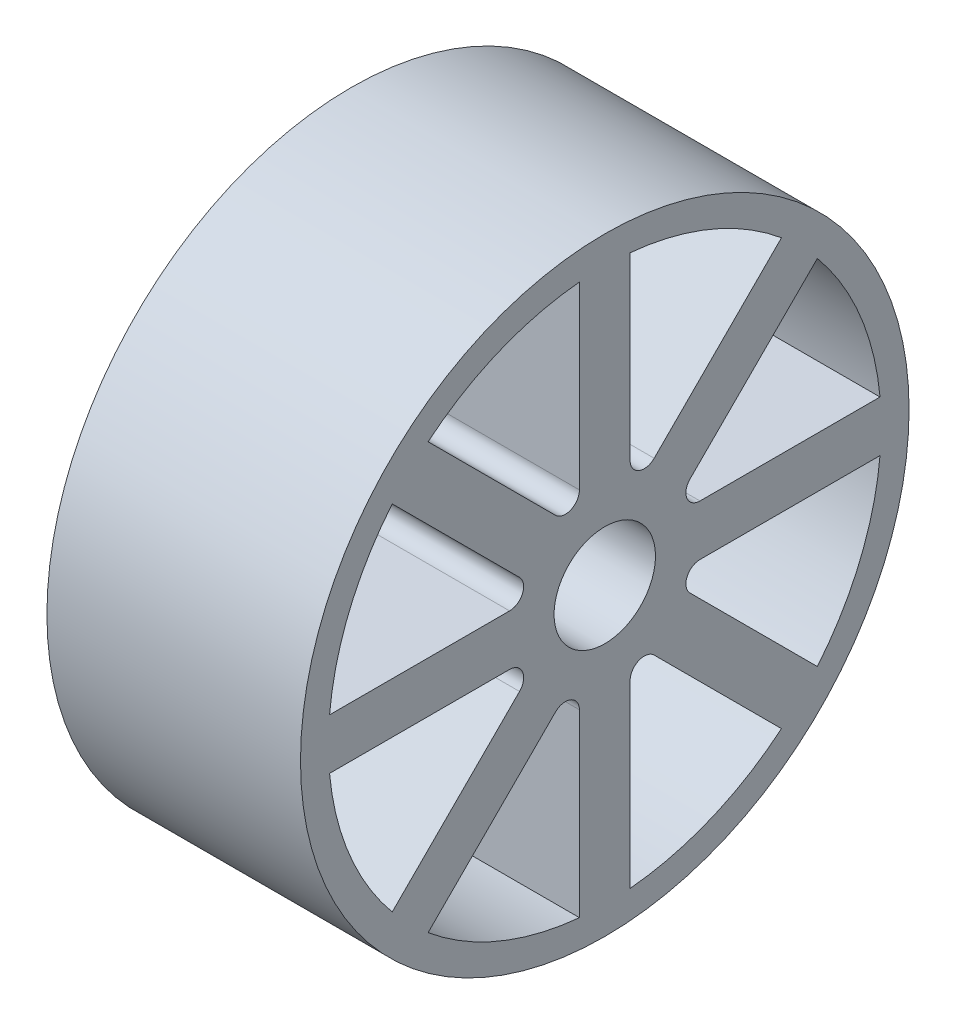
ISO-10303-21;
HEADER;
FILE_DESCRIPTION(('STEP AP214'),'2;1');
FILE_NAME('part.step','',(''),(''),'','','');
FILE_SCHEMA(('AUTOMOTIVE_DESIGN { 1 0 10303 214 1 1 1 1 }'));
ENDSEC;
DATA;
#1=APPLICATION_CONTEXT('core data for automotive mechanical design processes');
#2=APPLICATION_PROTOCOL_DEFINITION('international standard','automotive_design',2000,#1);
#3=PRODUCT_CONTEXT('',#1,'mechanical');
#4=PRODUCT('Part','Part','',(#3));
#5=PRODUCT_RELATED_PRODUCT_CATEGORY('part','',(#4));
#6=PRODUCT_DEFINITION_FORMATION('','',#4);
#7=PRODUCT_DEFINITION_CONTEXT('part definition',#1,'design');
#8=PRODUCT_DEFINITION('design','',#6,#7);
#9=PRODUCT_DEFINITION_SHAPE('','',#8);
#10=(LENGTH_UNIT() NAMED_UNIT(*) SI_UNIT(.MILLI.,.METRE.));
#11=(NAMED_UNIT(*) PLANE_ANGLE_UNIT() SI_UNIT($,.RADIAN.));
#12=(NAMED_UNIT(*) SI_UNIT($,.STERADIAN.) SOLID_ANGLE_UNIT());
#13=UNCERTAINTY_MEASURE_WITH_UNIT(LENGTH_MEASURE(1.E-05),#10,'distance_accuracy_value','');
#14=(GEOMETRIC_REPRESENTATION_CONTEXT(3) GLOBAL_UNCERTAINTY_ASSIGNED_CONTEXT((#13)) GLOBAL_UNIT_ASSIGNED_CONTEXT((#10,
#11,#12)) REPRESENTATION_CONTEXT('',''));
#15=CARTESIAN_POINT('',(0.,0.,0.));
#16=DIRECTION('',(0.,0.,1.));
#17=DIRECTION('',(1.,0.,0.));
#18=AXIS2_PLACEMENT_3D('',#15,#16,#17);
#19=CARTESIAN_POINT('',(0.,27.3861278752583,2.5));
#20=DIRECTION('',(0.,0.,-1.));
#21=DIRECTION('',(0.,1.,0.));
#22=AXIS2_PLACEMENT_3D('',#19,#20,#21);
#23=PLANE('',#22);
#24=DIRECTION('',(1.,0.,0.));
#25=VECTOR('',#24,1.);
#26=CARTESIAN_POINT('',(0.,27.1350787726883,2.5));
#27=LINE('',#26,#25);
#28=CARTESIAN_POINT('',(0.,27.1350787726883,2.5));
#29=VERTEX_POINT('',#28);
#30=CARTESIAN_POINT('',(25.,27.1350787726883,2.5));
#31=VERTEX_POINT('',#30);
#32=EDGE_CURVE('E48',#29,#31,#27,.T.);
#33=ORIENTED_EDGE('',*,*,#32,.F.);
#34=DIRECTION('',(0.,1.,0.));
#35=VECTOR('',#34,1.);
#36=CARTESIAN_POINT('',(0.,27.3861278752583,2.5));
#37=LINE('',#36,#35);
#38=CARTESIAN_POINT('',(0.,9.38612787525831,2.5));
#39=VERTEX_POINT('',#38);
#40=EDGE_CURVE('E461',#39,#29,#37,.T.);
#41=ORIENTED_EDGE('',*,*,#40,.F.);
#42=DIRECTION('',(1.,0.,0.));
#43=VECTOR('',#42,1.);
#44=CARTESIAN_POINT('',(0.,9.38612787525831,2.5));
#45=LINE('',#44,#43);
#46=CARTESIAN_POINT('',(25.,9.38612787525831,2.5));
#47=VERTEX_POINT('',#46);
#48=EDGE_CURVE('E469',#39,#47,#45,.T.);
#49=ORIENTED_EDGE('',*,*,#48,.T.);
#50=DIRECTION('',(0.,1.,0.));
#51=VECTOR('',#50,1.);
#52=CARTESIAN_POINT('',(25.,27.3861278752583,2.5));
#53=LINE('',#52,#51);
#54=EDGE_CURVE('E53',#47,#31,#53,.T.);
#55=ORIENTED_EDGE('',*,*,#54,.T.);
#56=EDGE_LOOP('',(#33,#41,#49,#55));
#57=FACE_BOUND('',#56,.T.);
#58=ADVANCED_FACE('F33',(#57),#23,.F.);
#59=CARTESIAN_POINT('',(0.,21.1326836840034,17.5971497780707));
#60=DIRECTION('',(0.,-0.707106781186548,0.707106781186547));
#61=DIRECTION('',(0.,-0.707106781186547,-0.707106781186548));
#62=AXIS2_PLACEMENT_3D('',#59,#60,#61);
#63=PLANE('',#62);
#64=DIRECTION('',(1.,0.,0.));
#65=VECTOR('',#64,1.);
#66=CARTESIAN_POINT('',(0.,20.9551651611654,17.4196312552327));
#67=LINE('',#66,#65);
#68=CARTESIAN_POINT('',(25.,20.9551651611654,17.4196312552327));
#69=VERTEX_POINT('',#68);
#70=CARTESIAN_POINT('',(0.,20.9551651611654,17.4196312552327));
#71=VERTEX_POINT('',#70);
#72=EDGE_CURVE('E320',#69,#71,#67,.F.);
#73=ORIENTED_EDGE('',*,*,#72,.F.);
#74=DIRECTION('',(0.,-0.707106781186547,-0.707106781186548));
#75=VECTOR('',#74,1.);
#76=CARTESIAN_POINT('',(25.,21.1326836840034,17.5971497780707));
#77=LINE('',#76,#75);
#78=CARTESIAN_POINT('',(25.,8.40476162264559,4.86922771671286));
#79=VERTEX_POINT('',#78);
#80=EDGE_CURVE('E454',#69,#79,#77,.T.);
#81=ORIENTED_EDGE('',*,*,#80,.T.);
#82=DIRECTION('',(1.,0.,0.));
#83=VECTOR('',#82,1.);
#84=CARTESIAN_POINT('',(0.,8.40476162264559,4.86922771671286));
#85=LINE('',#84,#83);
#86=CARTESIAN_POINT('',(0.,8.40476162264559,4.86922771671286));
#87=VERTEX_POINT('',#86);
#88=EDGE_CURVE('E463',#87,#79,#85,.T.);
#89=ORIENTED_EDGE('',*,*,#88,.F.);
#90=DIRECTION('',(0.,-0.707106781186547,-0.707106781186548));
#91=VECTOR('',#90,1.);
#92=CARTESIAN_POINT('',(0.,21.1326836840034,17.5971497780707));
#93=LINE('',#92,#91);
#94=EDGE_CURVE('E456',#71,#87,#93,.T.);
#95=ORIENTED_EDGE('',*,*,#94,.F.);
#96=EDGE_LOOP('',(#73,#81,#89,#95));
#97=FACE_BOUND('',#96,.T.);
#98=ADVANCED_FACE('F494',(#97),#63,.F.);
#99=CARTESIAN_POINT('',(0.,-17.5971497780701,-21.1326836840033));
#100=DIRECTION('',(0.,-0.707106781186548,0.707106781186547));
#101=DIRECTION('',(0.,-0.707106781186547,-0.707106781186548));
#102=AXIS2_PLACEMENT_3D('',#99,#100,#101);
#103=PLANE('',#102);
#104=DIRECTION('',(1.,0.,0.));
#105=VECTOR('',#104,1.);
#106=CARTESIAN_POINT('',(0.,-17.4196312552324,-20.9551651611656));
#107=LINE('',#106,#105);
#108=CARTESIAN_POINT('',(0.,-17.4196312552325,-20.9551651611656));
#109=VERTEX_POINT('',#108);
#110=CARTESIAN_POINT('',(25.,-17.4196312552325,-20.9551651611656));
#111=VERTEX_POINT('',#110);
#112=EDGE_CURVE('E317',#109,#111,#107,.T.);
#113=ORIENTED_EDGE('',*,*,#112,.F.);
#114=DIRECTION('',(0.,-0.707106781186547,-0.707106781186548));
#115=VECTOR('',#114,1.);
#116=CARTESIAN_POINT('',(0.,-17.5971497780701,-21.1326836840033));
#117=LINE('',#116,#115);
#118=CARTESIAN_POINT('',(0.,-4.86922771671227,-8.40476162264543));
#119=VERTEX_POINT('',#118);
#120=EDGE_CURVE('E433',#119,#109,#117,.T.);
#121=ORIENTED_EDGE('',*,*,#120,.F.);
#122=DIRECTION('',(1.,0.,0.));
#123=VECTOR('',#122,1.);
#124=CARTESIAN_POINT('',(0.,-4.86922771671227,-8.40476162264543));
#125=LINE('',#124,#123);
#126=CARTESIAN_POINT('',(25.,-4.86922771671227,-8.40476162264543));
#127=VERTEX_POINT('',#126);
#128=EDGE_CURVE('E418',#119,#127,#125,.T.);
#129=ORIENTED_EDGE('',*,*,#128,.T.);
#130=DIRECTION('',(0.,-0.707106781186547,-0.707106781186548));
#131=VECTOR('',#130,1.);
#132=CARTESIAN_POINT('',(25.,-17.5971497780701,-21.1326836840033));
#133=LINE('',#132,#131);
#134=EDGE_CURVE('E430',#127,#111,#133,.T.);
#135=ORIENTED_EDGE('',*,*,#134,.T.);
#136=EDGE_LOOP('',(#113,#121,#129,#135));
#137=FACE_BOUND('',#136,.T.);
#138=ADVANCED_FACE('F499',(#137),#103,.F.);
#139=CARTESIAN_POINT('',(0.,-2.49999999999941,-27.3861278752581));
#140=DIRECTION('',(0.,1.,0.));
#141=DIRECTION('',(0.,0.,1.));
#142=AXIS2_PLACEMENT_3D('',#139,#140,#141);
#143=PLANE('',#142);
#144=DIRECTION('',(1.,0.,0.));
#145=VECTOR('',#144,1.);
#146=CARTESIAN_POINT('',(0.,-2.49999999999941,-27.1350787726884));
#147=LINE('',#146,#145);
#148=CARTESIAN_POINT('',(25.,-2.49999999999941,-27.1350787726884));
#149=VERTEX_POINT('',#148);
#150=CARTESIAN_POINT('',(0.,-2.49999999999941,-27.1350787726884));
#151=VERTEX_POINT('',#150);
#152=EDGE_CURVE('E314',#149,#151,#147,.F.);
#153=ORIENTED_EDGE('',*,*,#152,.F.);
#154=DIRECTION('',(0.,0.,1.));
#155=VECTOR('',#154,1.);
#156=CARTESIAN_POINT('',(25.,-2.49999999999941,-27.3861278752581));
#157=LINE('',#156,#155);
#158=CARTESIAN_POINT('',(25.,-2.49999999999942,-9.38612787525813));
#159=VERTEX_POINT('',#158);
#160=EDGE_CURVE('E384',#149,#159,#157,.T.);
#161=ORIENTED_EDGE('',*,*,#160,.T.);
#162=DIRECTION('',(1.,0.,0.));
#163=VECTOR('',#162,1.);
#164=CARTESIAN_POINT('',(0.,-2.49999999999942,-9.38612787525813));
#165=LINE('',#164,#163);
#166=CARTESIAN_POINT('',(0.,-2.49999999999942,-9.38612787525813));
#167=VERTEX_POINT('',#166);
#168=EDGE_CURVE('E436',#167,#159,#165,.T.);
#169=ORIENTED_EDGE('',*,*,#168,.F.);
#170=DIRECTION('',(0.,0.,1.));
#171=VECTOR('',#170,1.);
#172=CARTESIAN_POINT('',(0.,-2.49999999999941,-27.3861278752581));
#173=LINE('',#172,#171);
#174=EDGE_CURVE('E427',#151,#167,#173,.T.);
#175=ORIENTED_EDGE('',*,*,#174,.F.);
#176=EDGE_LOOP('',(#153,#161,#169,#175));
#177=FACE_BOUND('',#176,.T.);
#178=ADVANCED_FACE('F516',(#177),#143,.F.);
#179=CARTESIAN_POINT('',(0.,2.4999999999999,-27.3861278752583));
#180=DIRECTION('',(0.,-1.,0.));
#181=DIRECTION('',(0.,0.,-1.));
#182=AXIS2_PLACEMENT_3D('',#179,#180,#181);
#183=PLANE('',#182);
#184=DIRECTION('',(1.,0.,0.));
#185=VECTOR('',#184,1.);
#186=CARTESIAN_POINT('',(0.,2.49999999999991,-27.1350787726883));
#187=LINE('',#186,#185);
#188=CARTESIAN_POINT('',(0.,2.49999999999991,-27.1350787726883));
#189=VERTEX_POINT('',#188);
#190=CARTESIAN_POINT('',(25.,2.49999999999991,-27.1350787726883));
#191=VERTEX_POINT('',#190);
#192=EDGE_CURVE('E311',#189,#191,#187,.T.);
#193=ORIENTED_EDGE('',*,*,#192,.F.);
#194=DIRECTION('',(0.,0.,-1.));
#195=VECTOR('',#194,1.);
#196=CARTESIAN_POINT('',(0.,2.4999999999999,-27.3861278752583));
#197=LINE('',#196,#195);
#198=CARTESIAN_POINT('',(0.,2.49999999999997,-9.38612787525831));
#199=VERTEX_POINT('',#198);
#200=EDGE_CURVE('E411',#199,#189,#197,.T.);
#201=ORIENTED_EDGE('',*,*,#200,.F.);
#202=DIRECTION('',(1.,0.,0.));
#203=VECTOR('',#202,1.);
#204=CARTESIAN_POINT('',(0.,2.49999999999997,-9.38612787525831));
#205=LINE('',#204,#203);
#206=CARTESIAN_POINT('',(25.,2.49999999999997,-9.38612787525831));
#207=VERTEX_POINT('',#206);
#208=EDGE_CURVE('E422',#199,#207,#205,.T.);
#209=ORIENTED_EDGE('',*,*,#208,.T.);
#210=DIRECTION('',(0.,0.,-1.));
#211=VECTOR('',#210,1.);
#212=CARTESIAN_POINT('',(25.,2.4999999999999,-27.3861278752583));
#213=LINE('',#212,#211);
#214=EDGE_CURVE('E408',#207,#191,#213,.T.);
#215=ORIENTED_EDGE('',*,*,#214,.T.);
#216=EDGE_LOOP('',(#193,#201,#209,#215));
#217=FACE_BOUND('',#216,.T.);
#218=ADVANCED_FACE('F519',(#217),#183,.F.);
#219=CARTESIAN_POINT('',(0.,17.5971497780706,-21.1326836840035));
#220=DIRECTION('',(0.,0.70710678118655,0.707106781186546));
#221=DIRECTION('',(0.,-0.707106781186546,0.70710678118655));
#222=AXIS2_PLACEMENT_3D('',#219,#220,#221);
#223=PLANE('',#222);
#224=DIRECTION('',(1.,0.,0.));
#225=VECTOR('',#224,1.);
#226=CARTESIAN_POINT('',(0.,17.4196312552326,-20.9551651611655));
#227=LINE('',#226,#225);
#228=CARTESIAN_POINT('',(25.,17.4196312552326,-20.9551651611655));
#229=VERTEX_POINT('',#228);
#230=CARTESIAN_POINT('',(0.,17.4196312552326,-20.9551651611655));
#231=VERTEX_POINT('',#230);
#232=EDGE_CURVE('E308',#229,#231,#227,.F.);
#233=ORIENTED_EDGE('',*,*,#232,.F.);
#234=DIRECTION('',(0.,-0.707106781186546,0.70710678118655));
#235=VECTOR('',#234,1.);
#236=CARTESIAN_POINT('',(25.,17.5971497780706,-21.1326836840035));
#237=LINE('',#236,#235);
#238=CARTESIAN_POINT('',(25.,4.86922771671283,-8.40476162264561));
#239=VERTEX_POINT('',#238);
#240=EDGE_CURVE('E415',#229,#239,#237,.T.);
#241=ORIENTED_EDGE('',*,*,#240,.T.);
#242=DIRECTION('',(1.,0.,0.));
#243=VECTOR('',#242,1.);
#244=CARTESIAN_POINT('',(0.,4.86922771671283,-8.40476162264561));
#245=LINE('',#244,#243);
#246=CARTESIAN_POINT('',(0.,4.86922771671283,-8.40476162264561));
#247=VERTEX_POINT('',#246);
#248=EDGE_CURVE('E414',#247,#239,#245,.T.);
#249=ORIENTED_EDGE('',*,*,#248,.F.);
#250=DIRECTION('',(0.,-0.707106781186546,0.70710678118655));
#251=VECTOR('',#250,1.);
#252=CARTESIAN_POINT('',(0.,17.5971497780706,-21.1326836840035));
#253=LINE('',#252,#251);
#254=EDGE_CURVE('E405',#231,#247,#253,.T.);
#255=ORIENTED_EDGE('',*,*,#254,.F.);
#256=EDGE_LOOP('',(#233,#241,#249,#255));
#257=FACE_BOUND('',#256,.T.);
#258=ADVANCED_FACE('F514',(#257),#223,.F.);
#259=CARTESIAN_POINT('',(0.,21.1326836840034,-17.5971497780708));
#260=DIRECTION('',(0.,-0.707106781186549,-0.707106781186546));
#261=DIRECTION('',(0.,0.707106781186546,-0.707106781186549));
#262=AXIS2_PLACEMENT_3D('',#259,#260,#261);
#263=PLANE('',#262);
#264=DIRECTION('',(1.,0.,0.));
#265=VECTOR('',#264,1.);
#266=CARTESIAN_POINT('',(0.,20.9551651611654,-17.4196312552327));
#267=LINE('',#266,#265);
#268=CARTESIAN_POINT('',(0.,20.9551651611654,-17.4196312552327));
#269=VERTEX_POINT('',#268);
#270=CARTESIAN_POINT('',(25.,20.9551651611654,-17.4196312552327));
#271=VERTEX_POINT('',#270);
#272=EDGE_CURVE('E262',#269,#271,#267,.T.);
#273=ORIENTED_EDGE('',*,*,#272,.F.);
#274=DIRECTION('',(0.,0.707106781186546,-0.707106781186549));
#275=VECTOR('',#274,1.);
#276=CARTESIAN_POINT('',(0.,21.1326836840034,-17.5971497780708));
#277=LINE('',#276,#275);
#278=CARTESIAN_POINT('',(0.,8.40476162264559,-4.86922771671288));
#279=VERTEX_POINT('',#278);
#280=EDGE_CURVE('E268',#279,#269,#277,.T.);
#281=ORIENTED_EDGE('',*,*,#280,.F.);
#282=DIRECTION('',(1.,0.,0.));
#283=VECTOR('',#282,1.);
#284=CARTESIAN_POINT('',(0.,8.40476162264559,-4.86922771671288));
#285=LINE('',#284,#283);
#286=CARTESIAN_POINT('',(25.,8.40476162264559,-4.86922771671288));
#287=VERTEX_POINT('',#286);
#288=EDGE_CURVE('E452',#279,#287,#285,.T.);
#289=ORIENTED_EDGE('',*,*,#288,.T.);
#290=DIRECTION('',(0.,0.707106781186546,-0.707106781186549));
#291=VECTOR('',#290,1.);
#292=CARTESIAN_POINT('',(25.,21.1326836840034,-17.5971497780708));
#293=LINE('',#292,#291);
#294=EDGE_CURVE('E252',#287,#271,#293,.T.);
#295=ORIENTED_EDGE('',*,*,#294,.T.);
#296=EDGE_LOOP('',(#273,#281,#289,#295));
#297=FACE_BOUND('',#296,.T.);
#298=ADVANCED_FACE('F505',(#297),#263,.F.);
#299=CARTESIAN_POINT('',(0.,27.3861278752583,-2.50000000000004));
#300=DIRECTION('',(0.,0.,1.));
#301=DIRECTION('',(0.,-1.,0.));
#302=AXIS2_PLACEMENT_3D('',#299,#300,#301);
#303=PLANE('',#302);
#304=DIRECTION('',(1.,0.,0.));
#305=VECTOR('',#304,1.);
#306=CARTESIAN_POINT('',(0.,27.1350787726883,-2.50000000000004));
#307=LINE('',#306,#305);
#308=CARTESIAN_POINT('',(25.,27.1350787726883,-2.50000000000004));
#309=VERTEX_POINT('',#308);
#310=CARTESIAN_POINT('',(0.,27.1350787726883,-2.50000000000004));
#311=VERTEX_POINT('',#310);
#312=EDGE_CURVE('E243',#309,#311,#307,.F.);
#313=ORIENTED_EDGE('',*,*,#312,.F.);
#314=DIRECTION('',(0.,-1.,0.));
#315=VECTOR('',#314,1.);
#316=CARTESIAN_POINT('',(25.,27.3861278752583,-2.50000000000004));
#317=LINE('',#316,#315);
#318=CARTESIAN_POINT('',(25.,9.3861278752583,-2.50000000000002));
#319=VERTEX_POINT('',#318);
#320=EDGE_CURVE('E424',#309,#319,#317,.T.);
#321=ORIENTED_EDGE('',*,*,#320,.T.);
#322=DIRECTION('',(1.,0.,0.));
#323=VECTOR('',#322,1.);
#324=CARTESIAN_POINT('',(0.,9.3861278752583,-2.50000000000002));
#325=LINE('',#324,#323);
#326=CARTESIAN_POINT('',(0.,9.3861278752583,-2.50000000000002));
#327=VERTEX_POINT('',#326);
#328=EDGE_CURVE('E246',#327,#319,#325,.T.);
#329=ORIENTED_EDGE('',*,*,#328,.F.);
#330=DIRECTION('',(0.,-1.,0.));
#331=VECTOR('',#330,1.);
#332=CARTESIAN_POINT('',(0.,27.3861278752583,-2.50000000000004));
#333=LINE('',#332,#331);
#334=EDGE_CURVE('E240',#311,#327,#333,.T.);
#335=ORIENTED_EDGE('',*,*,#334,.F.);
#336=EDGE_LOOP('',(#313,#321,#329,#335));
#337=FACE_BOUND('',#336,.T.);
#338=ADVANCED_FACE('F242',(#337),#303,.F.);
#339=CARTESIAN_POINT('',(0.,17.597149778071,21.1326836840032));
#340=DIRECTION('',(0.,0.707106781186539,-0.707106781186556));
#341=DIRECTION('',(0.,0.707106781186556,0.707106781186539));
#342=AXIS2_PLACEMENT_3D('',#339,#340,#341);
#343=PLANE('',#342);
#344=DIRECTION('',(1.,0.,0.));
#345=VECTOR('',#344,1.);
#346=CARTESIAN_POINT('',(0.,17.4196312552329,20.9551651611652));
#347=LINE('',#346,#345);
#348=CARTESIAN_POINT('',(0.,17.4196312552329,20.9551651611652));
#349=VERTEX_POINT('',#348);
#350=CARTESIAN_POINT('',(25.,17.4196312552329,20.9551651611652));
#351=VERTEX_POINT('',#350);
#352=EDGE_CURVE('E263',#349,#351,#347,.T.);
#353=ORIENTED_EDGE('',*,*,#352,.F.);
#354=DIRECTION('',(0.,0.707106781186556,0.707106781186539));
#355=VECTOR('',#354,1.);
#356=CARTESIAN_POINT('',(0.,17.597149778071,21.1326836840032));
#357=LINE('',#356,#355);
#358=CARTESIAN_POINT('',(0.,4.86922771671296,8.40476162264554));
#359=VERTEX_POINT('',#358);
#360=EDGE_CURVE('E353',#359,#349,#357,.T.);
#361=ORIENTED_EDGE('',*,*,#360,.F.);
#362=DIRECTION('',(1.,0.,0.));
#363=VECTOR('',#362,1.);
#364=CARTESIAN_POINT('',(0.,4.86922771671296,8.40476162264554));
#365=LINE('',#364,#363);
#366=CARTESIAN_POINT('',(25.,4.86922771671296,8.40476162264554));
#367=VERTEX_POINT('',#366);
#368=EDGE_CURVE('E338',#359,#367,#365,.T.);
#369=ORIENTED_EDGE('',*,*,#368,.T.);
#370=DIRECTION('',(0.,0.707106781186556,0.707106781186539));
#371=VECTOR('',#370,1.);
#372=CARTESIAN_POINT('',(25.,17.597149778071,21.1326836840032));
#373=LINE('',#372,#371);
#374=EDGE_CURVE('E350',#367,#351,#373,.T.);
#375=ORIENTED_EDGE('',*,*,#374,.T.);
#376=EDGE_LOOP('',(#353,#361,#369,#375));
#377=FACE_BOUND('',#376,.T.);
#378=ADVANCED_FACE('F504',(#377),#343,.F.);
#379=CARTESIAN_POINT('',(0.,2.50000000000032,27.3861278752583));
#380=DIRECTION('',(0.,-1.,0.));
#381=DIRECTION('',(0.,0.,-1.));
#382=AXIS2_PLACEMENT_3D('',#379,#380,#381);
#383=PLANE('',#382);
#384=DIRECTION('',(1.,0.,0.));
#385=VECTOR('',#384,1.);
#386=CARTESIAN_POINT('',(0.,2.50000000000032,27.1350787726883));
#387=LINE('',#386,#385);
#388=CARTESIAN_POINT('',(25.,2.50000000000032,27.1350787726883));
#389=VERTEX_POINT('',#388);
#390=CARTESIAN_POINT('',(0.,2.50000000000032,27.1350787726883));
#391=VERTEX_POINT('',#390);
#392=EDGE_CURVE('E302',#389,#391,#387,.F.);
#393=ORIENTED_EDGE('',*,*,#392,.F.);
#394=DIRECTION('',(0.,0.,-1.));
#395=VECTOR('',#394,1.);
#396=CARTESIAN_POINT('',(25.,2.50000000000032,27.3861278752583));
#397=LINE('',#396,#395);
#398=CARTESIAN_POINT('',(25.,2.50000000000011,9.38612787525827));
#399=VERTEX_POINT('',#398);
#400=EDGE_CURVE('E324',#389,#399,#397,.T.);
#401=ORIENTED_EDGE('',*,*,#400,.T.);
#402=DIRECTION('',(1.,0.,0.));
#403=VECTOR('',#402,1.);
#404=CARTESIAN_POINT('',(0.,2.50000000000011,9.38612787525827));
#405=LINE('',#404,#403);
#406=CARTESIAN_POINT('',(0.,2.50000000000011,9.38612787525827));
#407=VERTEX_POINT('',#406);
#408=EDGE_CURVE('E356',#407,#399,#405,.T.);
#409=ORIENTED_EDGE('',*,*,#408,.F.);
#410=DIRECTION('',(0.,0.,-1.));
#411=VECTOR('',#410,1.);
#412=CARTESIAN_POINT('',(0.,2.50000000000032,27.3861278752583));
#413=LINE('',#412,#411);
#414=EDGE_CURVE('E347',#391,#407,#413,.T.);
#415=ORIENTED_EDGE('',*,*,#414,.F.);
#416=EDGE_LOOP('',(#393,#401,#409,#415));
#417=FACE_BOUND('',#416,.T.);
#418=ADVANCED_FACE('F563',(#417),#383,.F.);
#419=CARTESIAN_POINT('',(0.,-2.49999999999971,27.3861278752583));
#420=DIRECTION('',(0.,1.,0.));
#421=DIRECTION('',(0.,0.,1.));
#422=AXIS2_PLACEMENT_3D('',#419,#420,#421);
#423=PLANE('',#422);
#424=DIRECTION('',(1.,0.,0.));
#425=VECTOR('',#424,1.);
#426=CARTESIAN_POINT('',(0.,-2.49999999999972,27.1350787726883));
#427=LINE('',#426,#425);
#428=CARTESIAN_POINT('',(0.,-2.49999999999972,27.1350787726883));
#429=VERTEX_POINT('',#428);
#430=CARTESIAN_POINT('',(25.,-2.49999999999972,27.1350787726883));
#431=VERTEX_POINT('',#430);
#432=EDGE_CURVE('E299',#429,#431,#427,.T.);
#433=ORIENTED_EDGE('',*,*,#432,.F.);
#434=DIRECTION('',(0.,0.,1.));
#435=VECTOR('',#434,1.);
#436=CARTESIAN_POINT('',(0.,-2.49999999999971,27.3861278752583));
#437=LINE('',#436,#435);
#438=CARTESIAN_POINT('',(0.,-2.4999999999999,9.38612787525833));
#439=VERTEX_POINT('',#438);
#440=EDGE_CURVE('E331',#439,#429,#437,.T.);
#441=ORIENTED_EDGE('',*,*,#440,.F.);
#442=DIRECTION('',(1.,0.,0.));
#443=VECTOR('',#442,1.);
#444=CARTESIAN_POINT('',(0.,-2.4999999999999,9.38612787525833));
#445=LINE('',#444,#443);
#446=CARTESIAN_POINT('',(25.,-2.4999999999999,9.38612787525833));
#447=VERTEX_POINT('',#446);
#448=EDGE_CURVE('E342',#439,#447,#445,.T.);
#449=ORIENTED_EDGE('',*,*,#448,.T.);
#450=DIRECTION('',(0.,0.,1.));
#451=VECTOR('',#450,1.);
#452=CARTESIAN_POINT('',(25.,-2.49999999999971,27.3861278752583));
#453=LINE('',#452,#451);
#454=EDGE_CURVE('E328',#447,#431,#453,.T.);
#455=ORIENTED_EDGE('',*,*,#454,.T.);
#456=EDGE_LOOP('',(#433,#441,#449,#455));
#457=FACE_BOUND('',#456,.T.);
#458=ADVANCED_FACE('F566',(#457),#423,.F.);
#459=CARTESIAN_POINT('',(0.,-17.5971497780705,21.1326836840036));
#460=DIRECTION('',(0.,-0.707106781186554,-0.70710678118654));
#461=DIRECTION('',(0.,0.707106781186541,-0.707106781186555));
#462=AXIS2_PLACEMENT_3D('',#459,#460,#461);
#463=PLANE('',#462);
#464=DIRECTION('',(1.,0.,0.));
#465=VECTOR('',#464,1.);
#466=CARTESIAN_POINT('',(0.,-17.4196312552325,20.9551651611656));
#467=LINE('',#466,#465);
#468=CARTESIAN_POINT('',(25.,-17.4196312552325,20.9551651611656));
#469=VERTEX_POINT('',#468);
#470=CARTESIAN_POINT('',(0.,-17.4196312552325,20.9551651611656));
#471=VERTEX_POINT('',#470);
#472=EDGE_CURVE('E296',#469,#471,#467,.F.);
#473=ORIENTED_EDGE('',*,*,#472,.F.);
#474=DIRECTION('',(0.,0.70710678118654,-0.707106781186554));
#475=VECTOR('',#474,1.);
#476=CARTESIAN_POINT('',(25.,-17.5971497780705,21.1326836840036));
#477=LINE('',#476,#475);
#478=CARTESIAN_POINT('',(25.,-4.86922771671277,8.40476162264565));
#479=VERTEX_POINT('',#478);
#480=EDGE_CURVE('E335',#469,#479,#477,.T.);
#481=ORIENTED_EDGE('',*,*,#480,.T.);
#482=DIRECTION('',(1.,0.,0.));
#483=VECTOR('',#482,1.);
#484=CARTESIAN_POINT('',(0.,-4.86922771671277,8.40476162264565));
#485=LINE('',#484,#483);
#486=CARTESIAN_POINT('',(0.,-4.86922771671277,8.40476162264565));
#487=VERTEX_POINT('',#486);
#488=EDGE_CURVE('E334',#487,#479,#485,.T.);
#489=ORIENTED_EDGE('',*,*,#488,.F.);
#490=DIRECTION('',(0.,0.70710678118654,-0.707106781186554));
#491=VECTOR('',#490,1.);
#492=CARTESIAN_POINT('',(0.,-17.5971497780705,21.1326836840036));
#493=LINE('',#492,#491);
#494=EDGE_CURVE('E325',#471,#487,#493,.T.);
#495=ORIENTED_EDGE('',*,*,#494,.F.);
#496=EDGE_LOOP('',(#473,#481,#489,#495));
#497=FACE_BOUND('',#496,.T.);
#498=ADVANCED_FACE('F550',(#497),#463,.F.);
#499=CARTESIAN_POINT('',(0.,-21.1326836840029,17.5971497780704));
#500=DIRECTION('',(0.,0.707106781186547,0.707106781186548));
#501=DIRECTION('',(0.,-0.707106781186548,0.707106781186547));
#502=AXIS2_PLACEMENT_3D('',#499,#500,#501);
#503=PLANE('',#502);
#504=DIRECTION('',(1.,0.,0.));
#505=VECTOR('',#504,1.);
#506=CARTESIAN_POINT('',(0.,-20.9551651611653,17.4196312552328));
#507=LINE('',#506,#505);
#508=CARTESIAN_POINT('',(0.,-20.9551651611653,17.4196312552328));
#509=VERTEX_POINT('',#508);
#510=CARTESIAN_POINT('',(25.,-20.9551651611653,17.4196312552328));
#511=VERTEX_POINT('',#510);
#512=EDGE_CURVE('E293',#509,#511,#507,.T.);
#513=ORIENTED_EDGE('',*,*,#512,.F.);
#514=DIRECTION('',(0.,-0.707106781186548,0.707106781186547));
#515=VECTOR('',#514,1.);
#516=CARTESIAN_POINT('',(0.,-21.1326836840029,17.5971497780704));
#517=LINE('',#516,#515);
#518=CARTESIAN_POINT('',(0.,-8.40476162264506,4.86922771671257));
#519=VERTEX_POINT('',#518);
#520=EDGE_CURVE('E393',#519,#509,#517,.T.);
#521=ORIENTED_EDGE('',*,*,#520,.F.);
#522=DIRECTION('',(1.,0.,0.));
#523=VECTOR('',#522,1.);
#524=CARTESIAN_POINT('',(0.,-8.40476162264506,4.86922771671257));
#525=LINE('',#524,#523);
#526=CARTESIAN_POINT('',(25.,-8.40476162264506,4.86922771671257));
#527=VERTEX_POINT('',#526);
#528=EDGE_CURVE('E378',#519,#527,#525,.T.);
#529=ORIENTED_EDGE('',*,*,#528,.T.);
#530=DIRECTION('',(0.,-0.707106781186548,0.707106781186547));
#531=VECTOR('',#530,1.);
#532=CARTESIAN_POINT('',(25.,-21.1326836840029,17.5971497780704));
#533=LINE('',#532,#531);
#534=EDGE_CURVE('E390',#527,#511,#533,.T.);
#535=ORIENTED_EDGE('',*,*,#534,.T.);
#536=EDGE_LOOP('',(#513,#521,#529,#535));
#537=FACE_BOUND('',#536,.T.);
#538=ADVANCED_FACE('F540',(#537),#503,.F.);
#539=CARTESIAN_POINT('',(0.,-27.3861278752578,2.49999999999969));
#540=DIRECTION('',(0.,0.,-1.));
#541=DIRECTION('',(0.,1.,0.));
#542=AXIS2_PLACEMENT_3D('',#539,#540,#541);
#543=PLANE('',#542);
#544=DIRECTION('',(1.,0.,0.));
#545=VECTOR('',#544,1.);
#546=CARTESIAN_POINT('',(0.,-27.1350787726883,2.49999999999969));
#547=LINE('',#546,#545);
#548=CARTESIAN_POINT('',(25.,-27.1350787726883,2.49999999999969));
#549=VERTEX_POINT('',#548);
#550=CARTESIAN_POINT('',(0.,-27.1350787726883,2.49999999999969));
#551=VERTEX_POINT('',#550);
#552=EDGE_CURVE('E290',#549,#551,#547,.F.);
#553=ORIENTED_EDGE('',*,*,#552,.F.);
#554=DIRECTION('',(0.,1.,0.));
#555=VECTOR('',#554,1.);
#556=CARTESIAN_POINT('',(25.,-27.3861278752578,2.49999999999969));
#557=LINE('',#556,#555);
#558=CARTESIAN_POINT('',(25.,-9.38612787525777,2.49999999999971));
#559=VERTEX_POINT('',#558);
#560=EDGE_CURVE('E344',#549,#559,#557,.T.);
#561=ORIENTED_EDGE('',*,*,#560,.T.);
#562=DIRECTION('',(1.,0.,0.));
#563=VECTOR('',#562,1.);
#564=CARTESIAN_POINT('',(0.,-9.38612787525777,2.49999999999971));
#565=LINE('',#564,#563);
#566=CARTESIAN_POINT('',(0.,-9.38612787525777,2.49999999999971));
#567=VERTEX_POINT('',#566);
#568=EDGE_CURVE('E396',#567,#559,#565,.T.);
#569=ORIENTED_EDGE('',*,*,#568,.F.);
#570=DIRECTION('',(0.,1.,0.));
#571=VECTOR('',#570,1.);
#572=CARTESIAN_POINT('',(0.,-27.3861278752578,2.49999999999969));
#573=LINE('',#572,#571);
#574=EDGE_CURVE('E387',#551,#567,#573,.T.);
#575=ORIENTED_EDGE('',*,*,#574,.F.);
#576=EDGE_LOOP('',(#553,#561,#569,#575));
#577=FACE_BOUND('',#576,.T.);
#578=ADVANCED_FACE('F536',(#577),#543,.F.);
#579=CARTESIAN_POINT('',(0.,-27.3861278752576,-2.50000000000008));
#580=DIRECTION('',(0.,0.,1.));
#581=DIRECTION('',(0.,-1.,0.));
#582=AXIS2_PLACEMENT_3D('',#579,#580,#581);
#583=PLANE('',#582);
#584=DIRECTION('',(1.,0.,0.));
#585=VECTOR('',#584,1.);
#586=CARTESIAN_POINT('',(0.,-27.1350787726883,-2.50000000000008));
#587=LINE('',#586,#585);
#588=CARTESIAN_POINT('',(0.,-27.1350787726883,-2.50000000000008));
#589=VERTEX_POINT('',#588);
#590=CARTESIAN_POINT('',(25.,-27.1350787726883,-2.50000000000008));
#591=VERTEX_POINT('',#590);
#592=EDGE_CURVE('E285',#589,#591,#587,.T.);
#593=ORIENTED_EDGE('',*,*,#592,.F.);
#594=DIRECTION('',(0.,-1.,0.));
#595=VECTOR('',#594,1.);
#596=CARTESIAN_POINT('',(0.,-27.3861278752576,-2.50000000000008));
#597=LINE('',#596,#595);
#598=CARTESIAN_POINT('',(0.,-9.38612787525765,-2.50000000000007));
#599=VERTEX_POINT('',#598);
#600=EDGE_CURVE('E371',#599,#589,#597,.T.);
#601=ORIENTED_EDGE('',*,*,#600,.F.);
#602=DIRECTION('',(1.,0.,0.));
#603=VECTOR('',#602,1.);
#604=CARTESIAN_POINT('',(0.,-9.38612787525765,-2.50000000000007));
#605=LINE('',#604,#603);
#606=CARTESIAN_POINT('',(25.,-9.38612787525765,-2.50000000000007));
#607=VERTEX_POINT('',#606);
#608=EDGE_CURVE('E382',#599,#607,#605,.T.);
#609=ORIENTED_EDGE('',*,*,#608,.T.);
#610=DIRECTION('',(0.,-1.,0.));
#611=VECTOR('',#610,1.);
#612=CARTESIAN_POINT('',(25.,-27.3861278752576,-2.50000000000008));
#613=LINE('',#612,#611);
#614=EDGE_CURVE('E368',#607,#591,#613,.T.);
#615=ORIENTED_EDGE('',*,*,#614,.T.);
#616=EDGE_LOOP('',(#593,#601,#609,#615));
#617=FACE_BOUND('',#616,.T.);
#618=ADVANCED_FACE('F539',(#617),#583,.F.);
#619=CARTESIAN_POINT('',(0.,-21.1326836840028,-17.5971497780708));
#620=DIRECTION('',(0.,0.707106781186548,-0.707106781186547));
#621=DIRECTION('',(0.,0.707106781186547,0.707106781186548));
#622=AXIS2_PLACEMENT_3D('',#619,#620,#621);
#623=PLANE('',#622);
#624=DIRECTION('',(1.,0.,0.));
#625=VECTOR('',#624,1.);
#626=CARTESIAN_POINT('',(0.,-20.9551651611651,-17.4196312552331));
#627=LINE('',#626,#625);
#628=CARTESIAN_POINT('',(25.,-20.9551651611651,-17.4196312552331));
#629=VERTEX_POINT('',#628);
#630=CARTESIAN_POINT('',(0.,-20.9551651611651,-17.4196312552331));
#631=VERTEX_POINT('',#630);
#632=EDGE_CURVE('E11',#629,#631,#627,.F.);
#633=ORIENTED_EDGE('',*,*,#632,.F.);
#634=DIRECTION('',(0.,0.707106781186547,0.707106781186548));
#635=VECTOR('',#634,1.);
#636=CARTESIAN_POINT('',(25.,-21.1326836840028,-17.5971497780708));
#637=LINE('',#636,#635);
#638=CARTESIAN_POINT('',(25.,-8.40476162264494,-4.86922771671293));
#639=VERTEX_POINT('',#638);
#640=EDGE_CURVE('E375',#629,#639,#637,.T.);
#641=ORIENTED_EDGE('',*,*,#640,.T.);
#642=DIRECTION('',(1.,0.,0.));
#643=VECTOR('',#642,1.);
#644=CARTESIAN_POINT('',(0.,-8.40476162264494,-4.86922771671293));
#645=LINE('',#644,#643);
#646=CARTESIAN_POINT('',(0.,-8.40476162264494,-4.86922771671293));
#647=VERTEX_POINT('',#646);
#648=EDGE_CURVE('E374',#647,#639,#645,.T.);
#649=ORIENTED_EDGE('',*,*,#648,.F.);
#650=DIRECTION('',(0.,0.707106781186547,0.707106781186548));
#651=VECTOR('',#650,1.);
#652=CARTESIAN_POINT('',(0.,-21.1326836840028,-17.5971497780708));
#653=LINE('',#652,#651);
#654=EDGE_CURVE('E365',#631,#647,#653,.T.);
#655=ORIENTED_EDGE('',*,*,#654,.F.);
#656=EDGE_LOOP('',(#633,#641,#649,#655));
#657=FACE_BOUND('',#656,.T.);
#658=ADVANCED_FACE('F552',(#657),#623,.F.);
#659=CARTESIAN_POINT('',(25.,0.,0.));
#660=DIRECTION('',(1.,0.,0.));
#661=DIRECTION('',(0.,0.,-1.));
#662=AXIS2_PLACEMENT_3D('',#659,#660,#661);
#663=PLANE('',#662);
#664=CARTESIAN_POINT('',(25.,0.,0.));
#665=DIRECTION('',(1.,0.,0.));
#666=DIRECTION('',(0.,0.,-1.));
#667=AXIS2_PLACEMENT_3D('',#664,#665,#666);
#668=CIRCLE('',#667,27.25);
#669=EDGE_CURVE('E261',#271,#309,#668,.T.);
#670=ORIENTED_EDGE('',*,*,#669,.F.);
#671=ORIENTED_EDGE('',*,*,#294,.F.);
#672=CARTESIAN_POINT('',(25.,9.3861278752583,-3.88786146410017));
#673=DIRECTION('',(1.,0.,0.));
#674=DIRECTION('',(0.,0.,-1.));
#675=AXIS2_PLACEMENT_3D('',#672,#673,#674);
#676=CIRCLE('',#675,1.38786146410015);
#677=EDGE_CURVE('E448',#319,#287,#676,.T.);
#678=ORIENTED_EDGE('',*,*,#677,.F.);
#679=ORIENTED_EDGE('',*,*,#320,.F.);
#680=EDGE_LOOP('',(#670,#671,#678,#679));
#681=FACE_BOUND('',#680,.T.);
#682=EDGE_CURVE('E638',#31,#69,#668,.T.);
#683=ORIENTED_EDGE('',*,*,#682,.F.);
#684=ORIENTED_EDGE('',*,*,#54,.F.);
#685=CARTESIAN_POINT('',(25.,9.38612787525831,3.88786146410015));
#686=DIRECTION('',(1.,0.,0.));
#687=DIRECTION('',(0.,0.,-1.));
#688=AXIS2_PLACEMENT_3D('',#685,#686,#687);
#689=CIRCLE('',#688,1.38786146410015);
#690=EDGE_CURVE('E465',#79,#47,#689,.T.);
#691=ORIENTED_EDGE('',*,*,#690,.F.);
#692=ORIENTED_EDGE('',*,*,#80,.F.);
#693=EDGE_LOOP('',(#683,#684,#691,#692));
#694=FACE_BOUND('',#693,.T.);
#695=EDGE_CURVE('E634',#351,#389,#668,.T.);
#696=ORIENTED_EDGE('',*,*,#695,.F.);
#697=ORIENTED_EDGE('',*,*,#374,.F.);
#698=CARTESIAN_POINT('',(25.,3.88786146410027,9.38612787525826));
#699=DIRECTION('',(1.,0.,0.));
#700=DIRECTION('',(0.,0.,-1.));
#701=AXIS2_PLACEMENT_3D('',#698,#699,#700);
#702=CIRCLE('',#701,1.38786146410015);
#703=EDGE_CURVE('E358',#399,#367,#702,.T.);
#704=ORIENTED_EDGE('',*,*,#703,.F.);
#705=ORIENTED_EDGE('',*,*,#400,.F.);
#706=EDGE_LOOP('',(#696,#697,#704,#705));
#707=FACE_BOUND('',#706,.T.);
#708=EDGE_CURVE('E631',#431,#469,#668,.T.);
#709=ORIENTED_EDGE('',*,*,#708,.F.);
#710=ORIENTED_EDGE('',*,*,#454,.F.);
#711=CARTESIAN_POINT('',(25.,-3.88786146410005,9.38612787525834));
#712=DIRECTION('',(1.,0.,0.));
#713=DIRECTION('',(0.,0.,-1.));
#714=AXIS2_PLACEMENT_3D('',#711,#712,#713);
#715=CIRCLE('',#714,1.38786146410015);
#716=EDGE_CURVE('E337',#479,#447,#715,.T.);
#717=ORIENTED_EDGE('',*,*,#716,.F.);
#718=ORIENTED_EDGE('',*,*,#480,.F.);
#719=EDGE_LOOP('',(#709,#710,#717,#718));
#720=FACE_BOUND('',#719,.T.);
#721=EDGE_CURVE('E629',#511,#549,#668,.T.);
#722=ORIENTED_EDGE('',*,*,#721,.F.);
#723=ORIENTED_EDGE('',*,*,#534,.F.);
#724=CARTESIAN_POINT('',(25.,-9.38612787525777,3.88786146409986));
#725=DIRECTION('',(1.,0.,0.));
#726=DIRECTION('',(0.,0.,-1.));
#727=AXIS2_PLACEMENT_3D('',#724,#725,#726);
#728=CIRCLE('',#727,1.38786146410015);
#729=EDGE_CURVE('E398',#559,#527,#728,.T.);
#730=ORIENTED_EDGE('',*,*,#729,.F.);
#731=ORIENTED_EDGE('',*,*,#560,.F.);
#732=EDGE_LOOP('',(#722,#723,#730,#731));
#733=FACE_BOUND('',#732,.T.);
#734=EDGE_CURVE('E628',#591,#629,#668,.T.);
#735=ORIENTED_EDGE('',*,*,#734,.F.);
#736=ORIENTED_EDGE('',*,*,#614,.F.);
#737=CARTESIAN_POINT('',(25.,-9.38612787525765,-3.88786146410022));
#738=DIRECTION('',(1.,0.,0.));
#739=DIRECTION('',(0.,0.,-1.));
#740=AXIS2_PLACEMENT_3D('',#737,#738,#739);
#741=CIRCLE('',#740,1.38786146410015);
#742=EDGE_CURVE('E377',#639,#607,#741,.T.);
#743=ORIENTED_EDGE('',*,*,#742,.F.);
#744=ORIENTED_EDGE('',*,*,#640,.F.);
#745=EDGE_LOOP('',(#735,#736,#743,#744));
#746=FACE_BOUND('',#745,.T.);
#747=EDGE_CURVE('E281',#111,#149,#668,.T.);
#748=ORIENTED_EDGE('',*,*,#747,.F.);
#749=ORIENTED_EDGE('',*,*,#134,.F.);
#750=CARTESIAN_POINT('',(25.,-3.88786146409957,-9.38612787525813));
#751=DIRECTION('',(1.,0.,0.));
#752=DIRECTION('',(0.,0.,-1.));
#753=AXIS2_PLACEMENT_3D('',#750,#751,#752);
#754=CIRCLE('',#753,1.38786146410015);
#755=EDGE_CURVE('E438',#159,#127,#754,.T.);
#756=ORIENTED_EDGE('',*,*,#755,.F.);
#757=ORIENTED_EDGE('',*,*,#160,.F.);
#758=EDGE_LOOP('',(#748,#749,#756,#757));
#759=FACE_BOUND('',#758,.T.);
#760=ORIENTED_EDGE('',*,*,#240,.F.);
#761=EDGE_CURVE('E278',#191,#229,#668,.T.);
#762=ORIENTED_EDGE('',*,*,#761,.F.);
#763=ORIENTED_EDGE('',*,*,#214,.F.);
#764=CARTESIAN_POINT('',(25.,3.88786146410012,-9.38612787525832));
#765=DIRECTION('',(1.,0.,0.));
#766=DIRECTION('',(0.,0.,-1.));
#767=AXIS2_PLACEMENT_3D('',#764,#765,#766);
#768=CIRCLE('',#767,1.38786146410015);
#769=EDGE_CURVE('E417',#239,#207,#768,.T.);
#770=ORIENTED_EDGE('',*,*,#769,.F.);
#771=EDGE_LOOP('',(#760,#762,#763,#770));
#772=FACE_BOUND('',#771,.T.);
#773=CARTESIAN_POINT('',(25.,0.,0.));
#774=DIRECTION('',(1.,0.,0.));
#775=DIRECTION('',(0.,0.,-1.));
#776=AXIS2_PLACEMENT_3D('',#773,#774,#775);
#777=CIRCLE('',#776,30.);
#778=CARTESIAN_POINT('',(25.,0.,-30.));
#779=VERTEX_POINT('',#778);
#780=EDGE_CURVE('E273',#779,#779,#777,.T.);
#781=ORIENTED_EDGE('',*,*,#780,.T.);
#782=EDGE_LOOP('',(#781));
#783=FACE_BOUND('',#782,.T.);
#784=CARTESIAN_POINT('',(25.,0.,0.));
#785=DIRECTION('',(1.,0.,0.));
#786=DIRECTION('',(0.,0.,-1.));
#787=AXIS2_PLACEMENT_3D('',#784,#785,#786);
#788=CIRCLE('',#787,5.);
#789=CARTESIAN_POINT('',(25.,0.,-5.));
#790=VERTEX_POINT('',#789);
#791=EDGE_CURVE('E41',#790,#790,#788,.T.);
#792=ORIENTED_EDGE('',*,*,#791,.F.);
#793=EDGE_LOOP('',(#792));
#794=FACE_BOUND('',#793,.T.);
#795=ADVANCED_FACE('F491',(#681,#694,#707,#720,#733,#746,#759,#772,#783,#794),#663,.T.);
#796=CARTESIAN_POINT('',(0.,0.,0.));
#797=DIRECTION('',(1.,0.,0.));
#798=DIRECTION('',(0.,0.,-1.));
#799=AXIS2_PLACEMENT_3D('',#796,#797,#798);
#800=PLANE('',#799);
#801=ORIENTED_EDGE('',*,*,#280,.T.);
#802=CARTESIAN_POINT('',(0.,0.,0.));
#803=DIRECTION('',(1.,0.,0.));
#804=DIRECTION('',(0.,0.,-1.));
#805=AXIS2_PLACEMENT_3D('',#802,#803,#804);
#806=CIRCLE('',#805,27.25);
#807=EDGE_CURVE('E259',#269,#311,#806,.T.);
#808=ORIENTED_EDGE('',*,*,#807,.T.);
#809=ORIENTED_EDGE('',*,*,#334,.T.);
#810=CARTESIAN_POINT('',(0.,9.3861278752583,-3.88786146410017));
#811=DIRECTION('',(1.,0.,0.));
#812=DIRECTION('',(0.,0.,-1.));
#813=AXIS2_PLACEMENT_3D('',#810,#811,#812);
#814=CIRCLE('',#813,1.38786146410015);
#815=EDGE_CURVE('E251',#327,#279,#814,.T.);
#816=ORIENTED_EDGE('',*,*,#815,.T.);
#817=EDGE_LOOP('',(#801,#808,#809,#816));
#818=FACE_BOUND('',#817,.T.);
#819=ORIENTED_EDGE('',*,*,#40,.T.);
#820=EDGE_CURVE('E270',#29,#71,#806,.T.);
#821=ORIENTED_EDGE('',*,*,#820,.T.);
#822=ORIENTED_EDGE('',*,*,#94,.T.);
#823=CARTESIAN_POINT('',(0.,9.38612787525831,3.88786146410015));
#824=DIRECTION('',(1.,0.,0.));
#825=DIRECTION('',(0.,0.,-1.));
#826=AXIS2_PLACEMENT_3D('',#823,#824,#825);
#827=CIRCLE('',#826,1.38786146410015);
#828=EDGE_CURVE('E458',#87,#39,#827,.T.);
#829=ORIENTED_EDGE('',*,*,#828,.T.);
#830=EDGE_LOOP('',(#819,#821,#822,#829));
#831=FACE_BOUND('',#830,.T.);
#832=ORIENTED_EDGE('',*,*,#360,.T.);
#833=EDGE_CURVE('E276',#349,#391,#806,.T.);
#834=ORIENTED_EDGE('',*,*,#833,.T.);
#835=ORIENTED_EDGE('',*,*,#414,.T.);
#836=CARTESIAN_POINT('',(0.,3.88786146410027,9.38612787525826));
#837=DIRECTION('',(1.,0.,0.));
#838=DIRECTION('',(0.,0.,-1.));
#839=AXIS2_PLACEMENT_3D('',#836,#837,#838);
#840=CIRCLE('',#839,1.38786146410015);
#841=EDGE_CURVE('E349',#407,#359,#840,.T.);
#842=ORIENTED_EDGE('',*,*,#841,.T.);
#843=EDGE_LOOP('',(#832,#834,#835,#842));
#844=FACE_BOUND('',#843,.T.);
#845=ORIENTED_EDGE('',*,*,#440,.T.);
#846=EDGE_CURVE('E613',#429,#471,#806,.T.);
#847=ORIENTED_EDGE('',*,*,#846,.T.);
#848=ORIENTED_EDGE('',*,*,#494,.T.);
#849=CARTESIAN_POINT('',(0.,-3.88786146410005,9.38612787525834));
#850=DIRECTION('',(1.,0.,0.));
#851=DIRECTION('',(0.,0.,-1.));
#852=AXIS2_PLACEMENT_3D('',#849,#850,#851);
#853=CIRCLE('',#852,1.38786146410015);
#854=EDGE_CURVE('E327',#487,#439,#853,.T.);
#855=ORIENTED_EDGE('',*,*,#854,.T.);
#856=EDGE_LOOP('',(#845,#847,#848,#855));
#857=FACE_BOUND('',#856,.T.);
#858=ORIENTED_EDGE('',*,*,#520,.T.);
#859=EDGE_CURVE('E611',#509,#551,#806,.T.);
#860=ORIENTED_EDGE('',*,*,#859,.T.);
#861=ORIENTED_EDGE('',*,*,#574,.T.);
#862=CARTESIAN_POINT('',(0.,-9.38612787525777,3.88786146409986));
#863=DIRECTION('',(1.,0.,0.));
#864=DIRECTION('',(0.,0.,-1.));
#865=AXIS2_PLACEMENT_3D('',#862,#863,#864);
#866=CIRCLE('',#865,1.38786146410015);
#867=EDGE_CURVE('E389',#567,#519,#866,.T.);
#868=ORIENTED_EDGE('',*,*,#867,.T.);
#869=EDGE_LOOP('',(#858,#860,#861,#868));
#870=FACE_BOUND('',#869,.T.);
#871=ORIENTED_EDGE('',*,*,#600,.T.);
#872=EDGE_CURVE('E607',#589,#631,#806,.T.);
#873=ORIENTED_EDGE('',*,*,#872,.T.);
#874=ORIENTED_EDGE('',*,*,#654,.T.);
#875=CARTESIAN_POINT('',(0.,-9.38612787525765,-3.88786146410022));
#876=DIRECTION('',(1.,0.,0.));
#877=DIRECTION('',(0.,0.,-1.));
#878=AXIS2_PLACEMENT_3D('',#875,#876,#877);
#879=CIRCLE('',#878,1.38786146410015);
#880=EDGE_CURVE('E367',#647,#599,#879,.T.);
#881=ORIENTED_EDGE('',*,*,#880,.T.);
#882=EDGE_LOOP('',(#871,#873,#874,#881));
#883=FACE_BOUND('',#882,.T.);
#884=ORIENTED_EDGE('',*,*,#120,.T.);
#885=EDGE_CURVE('E274',#109,#151,#806,.T.);
#886=ORIENTED_EDGE('',*,*,#885,.T.);
#887=ORIENTED_EDGE('',*,*,#174,.T.);
#888=CARTESIAN_POINT('',(0.,-3.88786146409957,-9.38612787525813));
#889=DIRECTION('',(1.,0.,0.));
#890=DIRECTION('',(0.,0.,-1.));
#891=AXIS2_PLACEMENT_3D('',#888,#889,#890);
#892=CIRCLE('',#891,1.38786146410015);
#893=EDGE_CURVE('E429',#167,#119,#892,.T.);
#894=ORIENTED_EDGE('',*,*,#893,.T.);
#895=EDGE_LOOP('',(#884,#886,#887,#894));
#896=FACE_BOUND('',#895,.T.);
#897=EDGE_CURVE('E269',#189,#231,#806,.T.);
#898=ORIENTED_EDGE('',*,*,#897,.T.);
#899=ORIENTED_EDGE('',*,*,#254,.T.);
#900=CARTESIAN_POINT('',(0.,3.88786146410012,-9.38612787525832));
#901=DIRECTION('',(1.,0.,0.));
#902=DIRECTION('',(0.,0.,-1.));
#903=AXIS2_PLACEMENT_3D('',#900,#901,#902);
#904=CIRCLE('',#903,1.38786146410015);
#905=EDGE_CURVE('E407',#247,#199,#904,.T.);
#906=ORIENTED_EDGE('',*,*,#905,.T.);
#907=ORIENTED_EDGE('',*,*,#200,.T.);
#908=EDGE_LOOP('',(#898,#899,#906,#907));
#909=FACE_BOUND('',#908,.T.);
#910=CARTESIAN_POINT('',(0.,0.,0.));
#911=DIRECTION('',(1.,0.,0.));
#912=DIRECTION('',(0.,0.,-1.));
#913=AXIS2_PLACEMENT_3D('',#910,#911,#912);
#914=CIRCLE('',#913,30.);
#915=CARTESIAN_POINT('',(0.,0.,-30.));
#916=VERTEX_POINT('',#915);
#917=EDGE_CURVE('E282',#916,#916,#914,.T.);
#918=ORIENTED_EDGE('',*,*,#917,.F.);
#919=EDGE_LOOP('',(#918));
#920=FACE_BOUND('',#919,.T.);
#921=CARTESIAN_POINT('',(0.,0.,0.));
#922=DIRECTION('',(1.,0.,0.));
#923=DIRECTION('',(0.,0.,-1.));
#924=AXIS2_PLACEMENT_3D('',#921,#922,#923);
#925=CIRCLE('',#924,5.);
#926=CARTESIAN_POINT('',(0.,0.,-5.));
#927=VERTEX_POINT('',#926);
#928=EDGE_CURVE('E471',#927,#927,#925,.T.);
#929=ORIENTED_EDGE('',*,*,#928,.T.);
#930=EDGE_LOOP('',(#929));
#931=FACE_BOUND('',#930,.T.);
#932=ADVANCED_FACE('F35',(#818,#831,#844,#857,#870,#883,#896,#909,#920,#931),#800,.F.);
#933=CARTESIAN_POINT('',(25.,0.,0.));
#934=DIRECTION('',(-1.,0.,0.));
#935=DIRECTION('',(0.,0.,1.));
#936=AXIS2_PLACEMENT_3D('',#933,#934,#935);
#937=CYLINDRICAL_SURFACE('',#936,5.);
#938=ORIENTED_EDGE('',*,*,#791,.T.);
#939=EDGE_LOOP('',(#938));
#940=FACE_BOUND('',#939,.T.);
#941=ORIENTED_EDGE('',*,*,#928,.F.);
#942=EDGE_LOOP('',(#941));
#943=FACE_BOUND('',#942,.T.);
#944=ADVANCED_FACE('F479',(#940,#943),#937,.F.);
#945=CARTESIAN_POINT('',(0.,9.38612787525831,3.88786146410015));
#946=DIRECTION('',(1.,0.,0.));
#947=DIRECTION('',(0.,0.,-1.));
#948=AXIS2_PLACEMENT_3D('',#945,#946,#947);
#949=CYLINDRICAL_SURFACE('',#948,1.38786146410015);
#950=ORIENTED_EDGE('',*,*,#690,.T.);
#951=ORIENTED_EDGE('',*,*,#48,.F.);
#952=ORIENTED_EDGE('',*,*,#828,.F.);
#953=ORIENTED_EDGE('',*,*,#88,.T.);
#954=EDGE_LOOP('',(#950,#951,#952,#953));
#955=FACE_BOUND('',#954,.T.);
#956=ADVANCED_FACE('F481',(#955),#949,.F.);
#957=CARTESIAN_POINT('',(0.,-3.88786146409957,-9.38612787525813));
#958=DIRECTION('',(1.,0.,0.));
#959=DIRECTION('',(0.,0.,-1.));
#960=AXIS2_PLACEMENT_3D('',#957,#958,#959);
#961=CYLINDRICAL_SURFACE('',#960,1.38786146410015);
#962=ORIENTED_EDGE('',*,*,#755,.T.);
#963=ORIENTED_EDGE('',*,*,#128,.F.);
#964=ORIENTED_EDGE('',*,*,#893,.F.);
#965=ORIENTED_EDGE('',*,*,#168,.T.);
#966=EDGE_LOOP('',(#962,#963,#964,#965));
#967=FACE_BOUND('',#966,.T.);
#968=ADVANCED_FACE('F488',(#967),#961,.F.);
#969=CARTESIAN_POINT('',(0.,3.88786146410012,-9.38612787525832));
#970=DIRECTION('',(1.,0.,0.));
#971=DIRECTION('',(0.,0.,-1.));
#972=AXIS2_PLACEMENT_3D('',#969,#970,#971);
#973=CYLINDRICAL_SURFACE('',#972,1.38786146410015);
#974=ORIENTED_EDGE('',*,*,#769,.T.);
#975=ORIENTED_EDGE('',*,*,#208,.F.);
#976=ORIENTED_EDGE('',*,*,#905,.F.);
#977=ORIENTED_EDGE('',*,*,#248,.T.);
#978=EDGE_LOOP('',(#974,#975,#976,#977));
#979=FACE_BOUND('',#978,.T.);
#980=ADVANCED_FACE('F510',(#979),#973,.F.);
#981=CARTESIAN_POINT('',(0.,9.3861278752583,-3.88786146410017));
#982=DIRECTION('',(1.,0.,0.));
#983=DIRECTION('',(0.,0.,-1.));
#984=AXIS2_PLACEMENT_3D('',#981,#982,#983);
#985=CYLINDRICAL_SURFACE('',#984,1.38786146410015);
#986=ORIENTED_EDGE('',*,*,#677,.T.);
#987=ORIENTED_EDGE('',*,*,#288,.F.);
#988=ORIENTED_EDGE('',*,*,#815,.F.);
#989=ORIENTED_EDGE('',*,*,#328,.T.);
#990=EDGE_LOOP('',(#986,#987,#988,#989));
#991=FACE_BOUND('',#990,.T.);
#992=ADVANCED_FACE('F506',(#991),#985,.F.);
#993=CARTESIAN_POINT('',(0.,3.88786146410027,9.38612787525826));
#994=DIRECTION('',(1.,0.,0.));
#995=DIRECTION('',(0.,0.,-1.));
#996=AXIS2_PLACEMENT_3D('',#993,#994,#995);
#997=CYLINDRICAL_SURFACE('',#996,1.38786146410015);
#998=ORIENTED_EDGE('',*,*,#703,.T.);
#999=ORIENTED_EDGE('',*,*,#368,.F.);
#1000=ORIENTED_EDGE('',*,*,#841,.F.);
#1001=ORIENTED_EDGE('',*,*,#408,.T.);
#1002=EDGE_LOOP('',(#998,#999,#1000,#1001));
#1003=FACE_BOUND('',#1002,.T.);
#1004=ADVANCED_FACE('F509',(#1003),#997,.F.);
#1005=CARTESIAN_POINT('',(0.,-3.88786146410005,9.38612787525834));
#1006=DIRECTION('',(1.,0.,0.));
#1007=DIRECTION('',(0.,0.,-1.));
#1008=AXIS2_PLACEMENT_3D('',#1005,#1006,#1007);
#1009=CYLINDRICAL_SURFACE('',#1008,1.38786146410015);
#1010=ORIENTED_EDGE('',*,*,#716,.T.);
#1011=ORIENTED_EDGE('',*,*,#448,.F.);
#1012=ORIENTED_EDGE('',*,*,#854,.F.);
#1013=ORIENTED_EDGE('',*,*,#488,.T.);
#1014=EDGE_LOOP('',(#1010,#1011,#1012,#1013));
#1015=FACE_BOUND('',#1014,.T.);
#1016=ADVANCED_FACE('F546',(#1015),#1009,.F.);
#1017=CARTESIAN_POINT('',(0.,-9.38612787525777,3.88786146409986));
#1018=DIRECTION('',(1.,0.,0.));
#1019=DIRECTION('',(0.,0.,-1.));
#1020=AXIS2_PLACEMENT_3D('',#1017,#1018,#1019);
#1021=CYLINDRICAL_SURFACE('',#1020,1.38786146410015);
#1022=ORIENTED_EDGE('',*,*,#729,.T.);
#1023=ORIENTED_EDGE('',*,*,#528,.F.);
#1024=ORIENTED_EDGE('',*,*,#867,.F.);
#1025=ORIENTED_EDGE('',*,*,#568,.T.);
#1026=EDGE_LOOP('',(#1022,#1023,#1024,#1025));
#1027=FACE_BOUND('',#1026,.T.);
#1028=ADVANCED_FACE('F542',(#1027),#1021,.F.);
#1029=CARTESIAN_POINT('',(0.,-9.38612787525765,-3.88786146410022));
#1030=DIRECTION('',(1.,0.,0.));
#1031=DIRECTION('',(0.,0.,-1.));
#1032=AXIS2_PLACEMENT_3D('',#1029,#1030,#1031);
#1033=CYLINDRICAL_SURFACE('',#1032,1.38786146410015);
#1034=ORIENTED_EDGE('',*,*,#742,.T.);
#1035=ORIENTED_EDGE('',*,*,#608,.F.);
#1036=ORIENTED_EDGE('',*,*,#880,.F.);
#1037=ORIENTED_EDGE('',*,*,#648,.T.);
#1038=EDGE_LOOP('',(#1034,#1035,#1036,#1037));
#1039=FACE_BOUND('',#1038,.T.);
#1040=ADVANCED_FACE('F545',(#1039),#1033,.F.);
#1041=CARTESIAN_POINT('',(0.,0.,0.));
#1042=DIRECTION('',(1.,0.,0.));
#1043=DIRECTION('',(0.,0.,-1.));
#1044=AXIS2_PLACEMENT_3D('',#1041,#1042,#1043);
#1045=CYLINDRICAL_SURFACE('',#1044,27.25);
#1046=ORIENTED_EDGE('',*,*,#820,.F.);
#1047=ORIENTED_EDGE('',*,*,#32,.T.);
#1048=ORIENTED_EDGE('',*,*,#682,.T.);
#1049=ORIENTED_EDGE('',*,*,#72,.T.);
#1050=EDGE_LOOP('',(#1046,#1047,#1048,#1049));
#1051=FACE_BOUND('',#1050,.T.);
#1052=ADVANCED_FACE('F558',(#1051),#1045,.F.);
#1053=ORIENTED_EDGE('',*,*,#885,.F.);
#1054=ORIENTED_EDGE('',*,*,#112,.T.);
#1055=ORIENTED_EDGE('',*,*,#747,.T.);
#1056=ORIENTED_EDGE('',*,*,#152,.T.);
#1057=EDGE_LOOP('',(#1053,#1054,#1055,#1056));
#1058=FACE_BOUND('',#1057,.T.);
#1059=ADVANCED_FACE('F589',(#1058),#1045,.F.);
#1060=ORIENTED_EDGE('',*,*,#897,.F.);
#1061=ORIENTED_EDGE('',*,*,#192,.T.);
#1062=ORIENTED_EDGE('',*,*,#761,.T.);
#1063=ORIENTED_EDGE('',*,*,#232,.T.);
#1064=EDGE_LOOP('',(#1060,#1061,#1062,#1063));
#1065=FACE_BOUND('',#1064,.T.);
#1066=ADVANCED_FACE('F594',(#1065),#1045,.F.);
#1067=ORIENTED_EDGE('',*,*,#807,.F.);
#1068=ORIENTED_EDGE('',*,*,#272,.T.);
#1069=ORIENTED_EDGE('',*,*,#669,.T.);
#1070=ORIENTED_EDGE('',*,*,#312,.T.);
#1071=EDGE_LOOP('',(#1067,#1068,#1069,#1070));
#1072=FACE_BOUND('',#1071,.T.);
#1073=ADVANCED_FACE('F257',(#1072),#1045,.F.);
#1074=ORIENTED_EDGE('',*,*,#833,.F.);
#1075=ORIENTED_EDGE('',*,*,#352,.T.);
#1076=ORIENTED_EDGE('',*,*,#695,.T.);
#1077=ORIENTED_EDGE('',*,*,#392,.T.);
#1078=EDGE_LOOP('',(#1074,#1075,#1076,#1077));
#1079=FACE_BOUND('',#1078,.T.);
#1080=ADVANCED_FACE('F707',(#1079),#1045,.F.);
#1081=ORIENTED_EDGE('',*,*,#846,.F.);
#1082=ORIENTED_EDGE('',*,*,#432,.T.);
#1083=ORIENTED_EDGE('',*,*,#708,.T.);
#1084=ORIENTED_EDGE('',*,*,#472,.T.);
#1085=EDGE_LOOP('',(#1081,#1082,#1083,#1084));
#1086=FACE_BOUND('',#1085,.T.);
#1087=ADVANCED_FACE('F603',(#1086),#1045,.F.);
#1088=ORIENTED_EDGE('',*,*,#859,.F.);
#1089=ORIENTED_EDGE('',*,*,#512,.T.);
#1090=ORIENTED_EDGE('',*,*,#721,.T.);
#1091=ORIENTED_EDGE('',*,*,#552,.T.);
#1092=EDGE_LOOP('',(#1088,#1089,#1090,#1091));
#1093=FACE_BOUND('',#1092,.T.);
#1094=ADVANCED_FACE('F598',(#1093),#1045,.F.);
#1095=ORIENTED_EDGE('',*,*,#872,.F.);
#1096=ORIENTED_EDGE('',*,*,#592,.T.);
#1097=ORIENTED_EDGE('',*,*,#734,.T.);
#1098=ORIENTED_EDGE('',*,*,#632,.T.);
#1099=EDGE_LOOP('',(#1095,#1096,#1097,#1098));
#1100=FACE_BOUND('',#1099,.T.);
#1101=ADVANCED_FACE('F586',(#1100),#1045,.F.);
#1102=CARTESIAN_POINT('',(0.,0.,0.));
#1103=DIRECTION('',(1.,0.,0.));
#1104=DIRECTION('',(0.,0.,-1.));
#1105=AXIS2_PLACEMENT_3D('',#1102,#1103,#1104);
#1106=CYLINDRICAL_SURFACE('',#1105,30.);
#1107=ORIENTED_EDGE('',*,*,#917,.T.);
#1108=EDGE_LOOP('',(#1107));
#1109=FACE_BOUND('',#1108,.T.);
#1110=ORIENTED_EDGE('',*,*,#780,.F.);
#1111=EDGE_LOOP('',(#1110));
#1112=FACE_BOUND('',#1111,.T.);
#1113=ADVANCED_FACE('F583',(#1109,#1112),#1106,.T.);
#1114=CLOSED_SHELL('',(#58,#98,#138,#178,#218,#258,#298,#338,#378,#418,#458,#498,#538,#578,#618,
#658,#795,#932,#944,#956,#968,#980,#992,#1004,#1016,#1028,#1040,#1052,#1059,#1066,#1073,#1080,
#1087,#1094,#1101,#1113));
#1115=MANIFOLD_SOLID_BREP('B2',#1114);
#1116=ADVANCED_BREP_SHAPE_REPRESENTATION('',(#18,#1115),#14);
#1117=SHAPE_DEFINITION_REPRESENTATION(#9,#1116);
ENDSEC;
END-ISO-10303-21;
